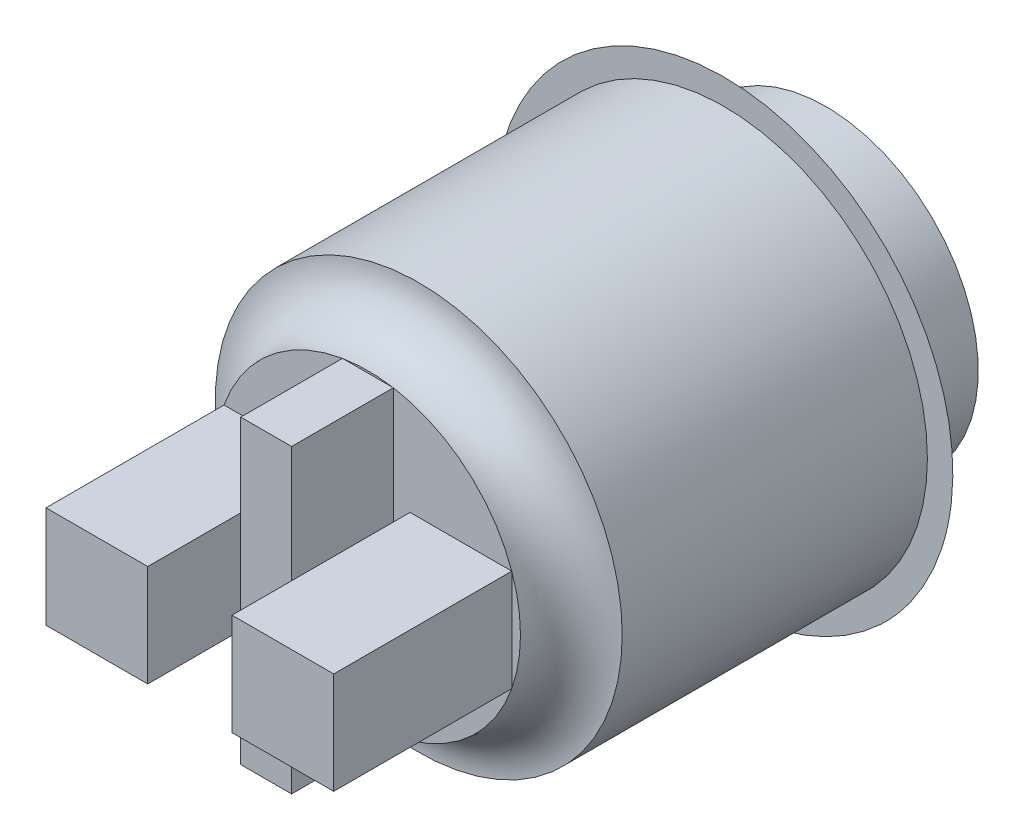
ISO-10303-21;
HEADER;
FILE_DESCRIPTION(('STEP AP214'),'2;1');
FILE_NAME('part.step','',(''),(''),'','','');
FILE_SCHEMA(('AUTOMOTIVE_DESIGN { 1 0 10303 214 1 1 1 1 }'));
ENDSEC;
DATA;
#1=APPLICATION_CONTEXT('core data for automotive mechanical design processes');
#2=APPLICATION_PROTOCOL_DEFINITION('international standard','automotive_design',2000,#1);
#3=PRODUCT_CONTEXT('',#1,'mechanical');
#4=PRODUCT('Part','Part','',(#3));
#5=PRODUCT_RELATED_PRODUCT_CATEGORY('part','',(#4));
#6=PRODUCT_DEFINITION_FORMATION('','',#4);
#7=PRODUCT_DEFINITION_CONTEXT('part definition',#1,'design');
#8=PRODUCT_DEFINITION('design','',#6,#7);
#9=PRODUCT_DEFINITION_SHAPE('','',#8);
#10=(LENGTH_UNIT() NAMED_UNIT(*) SI_UNIT(.MILLI.,.METRE.));
#11=(NAMED_UNIT(*) PLANE_ANGLE_UNIT() SI_UNIT($,.RADIAN.));
#12=(NAMED_UNIT(*) SI_UNIT($,.STERADIAN.) SOLID_ANGLE_UNIT());
#13=UNCERTAINTY_MEASURE_WITH_UNIT(LENGTH_MEASURE(1.E-05),#10,'distance_accuracy_value','');
#14=(GEOMETRIC_REPRESENTATION_CONTEXT(3) GLOBAL_UNCERTAINTY_ASSIGNED_CONTEXT((#13)) GLOBAL_UNIT_ASSIGNED_CONTEXT((#10,
#11,#12)) REPRESENTATION_CONTEXT('',''));
#15=CARTESIAN_POINT('',(0.,0.,0.));
#16=DIRECTION('',(0.,0.,1.));
#17=DIRECTION('',(1.,0.,0.));
#18=AXIS2_PLACEMENT_3D('',#15,#16,#17);
#19=CARTESIAN_POINT('',(0.,0.,14.));
#20=DIRECTION('',(0.,0.,1.));
#21=DIRECTION('',(1.,0.,0.));
#22=AXIS2_PLACEMENT_3D('',#19,#20,#21);
#23=PLANE('',#22);
#24=CARTESIAN_POINT('',(0.,0.,14.));
#25=DIRECTION('',(0.,0.,1.));
#26=DIRECTION('',(1.,0.,0.));
#27=AXIS2_PLACEMENT_3D('',#24,#25,#26);
#28=CIRCLE('',#27,6.);
#29=CARTESIAN_POINT('',(-1.,-5.91607978309962,14.));
#30=VERTEX_POINT('',#29);
#31=CARTESIAN_POINT('',(1.,-5.91607978309962,14.));
#32=VERTEX_POINT('',#31);
#33=EDGE_CURVE('E330',#30,#32,#28,.T.);
#34=ORIENTED_EDGE('',*,*,#33,.T.);
#35=DIRECTION('',(1.,0.,0.));
#36=VECTOR('',#35,1.);
#37=CARTESIAN_POINT('',(-1.,-5.91607978309962,14.));
#38=LINE('',#37,#36);
#39=EDGE_CURVE('E161',#30,#32,#38,.T.);
#40=ORIENTED_EDGE('',*,*,#39,.F.);
#41=EDGE_LOOP('',(#34,#40));
#42=FACE_BOUND('',#41,.T.);
#43=ADVANCED_FACE('F41',(#42),#23,.T.);
#44=CARTESIAN_POINT('',(5.65685424949238,2.,14.));
#45=VERTEX_POINT('',#44);
#46=CARTESIAN_POINT('',(1.,5.91607978309962,14.));
#47=VERTEX_POINT('',#46);
#48=EDGE_CURVE('E339',#45,#47,#28,.T.);
#49=ORIENTED_EDGE('',*,*,#48,.T.);
#50=DIRECTION('',(0.,1.,0.));
#51=VECTOR('',#50,1.);
#52=CARTESIAN_POINT('',(1.,-5.91607978309962,14.));
#53=LINE('',#52,#51);
#54=EDGE_CURVE('E596',#32,#47,#53,.T.);
#55=ORIENTED_EDGE('',*,*,#54,.F.);
#56=CARTESIAN_POINT('',(5.65685424949238,-2.,14.));
#57=VERTEX_POINT('',#56);
#58=EDGE_CURVE('E68',#32,#57,#28,.T.);
#59=ORIENTED_EDGE('',*,*,#58,.T.);
#60=DIRECTION('',(1.,0.,0.));
#61=VECTOR('',#60,1.);
#62=CARTESIAN_POINT('',(1.65685424949238,-2.,14.));
#63=LINE('',#62,#61);
#64=CARTESIAN_POINT('',(1.65685424949238,-2.,14.));
#65=VERTEX_POINT('',#64);
#66=EDGE_CURVE('E190',#65,#57,#63,.T.);
#67=ORIENTED_EDGE('',*,*,#66,.F.);
#68=DIRECTION('',(0.,-1.,0.));
#69=VECTOR('',#68,1.);
#70=CARTESIAN_POINT('',(1.65685424949238,2.,14.));
#71=LINE('',#70,#69);
#72=CARTESIAN_POINT('',(1.65685424949238,2.,14.));
#73=VERTEX_POINT('',#72);
#74=EDGE_CURVE('E168',#73,#65,#71,.T.);
#75=ORIENTED_EDGE('',*,*,#74,.F.);
#76=DIRECTION('',(-1.,0.,0.));
#77=VECTOR('',#76,1.);
#78=CARTESIAN_POINT('',(5.65685424949238,2.,14.));
#79=LINE('',#78,#77);
#80=EDGE_CURVE('E163',#45,#73,#79,.T.);
#81=ORIENTED_EDGE('',*,*,#80,.F.);
#82=EDGE_LOOP('',(#49,#55,#59,#67,#75,#81));
#83=FACE_BOUND('',#82,.T.);
#84=ADVANCED_FACE('F304',(#83),#23,.T.);
#85=CARTESIAN_POINT('',(-0.999999999999992,5.91607978309962,14.));
#86=VERTEX_POINT('',#85);
#87=EDGE_CURVE('E345',#47,#86,#28,.T.);
#88=ORIENTED_EDGE('',*,*,#87,.T.);
#89=DIRECTION('',(-1.,0.,0.));
#90=VECTOR('',#89,1.);
#91=CARTESIAN_POINT('',(-1.,5.91607978309962,14.));
#92=LINE('',#91,#90);
#93=EDGE_CURVE('E591',#47,#86,#92,.T.);
#94=ORIENTED_EDGE('',*,*,#93,.F.);
#95=EDGE_LOOP('',(#88,#94));
#96=FACE_BOUND('',#95,.T.);
#97=ADVANCED_FACE('F310',(#96),#23,.T.);
#98=CARTESIAN_POINT('',(-5.65685424949238,-2.,14.));
#99=VERTEX_POINT('',#98);
#100=EDGE_CURVE('E257',#99,#30,#28,.T.);
#101=ORIENTED_EDGE('',*,*,#100,.T.);
#102=DIRECTION('',(0.,-1.,0.));
#103=VECTOR('',#102,1.);
#104=CARTESIAN_POINT('',(-1.,-5.91607978309962,14.));
#105=LINE('',#104,#103);
#106=EDGE_CURVE('E157',#86,#30,#105,.T.);
#107=ORIENTED_EDGE('',*,*,#106,.F.);
#108=CARTESIAN_POINT('',(-5.65685424949238,2.,14.));
#109=VERTEX_POINT('',#108);
#110=EDGE_CURVE('E251',#86,#109,#28,.T.);
#111=ORIENTED_EDGE('',*,*,#110,.T.);
#112=DIRECTION('',(-1.,0.,0.));
#113=VECTOR('',#112,1.);
#114=CARTESIAN_POINT('',(-5.65685424949238,2.,14.));
#115=LINE('',#114,#113);
#116=CARTESIAN_POINT('',(-1.65685424949238,2.,14.));
#117=VERTEX_POINT('',#116);
#118=EDGE_CURVE('E209',#117,#109,#115,.T.);
#119=ORIENTED_EDGE('',*,*,#118,.F.);
#120=DIRECTION('',(0.,1.,0.));
#121=VECTOR('',#120,1.);
#122=CARTESIAN_POINT('',(-1.65685424949238,2.,14.));
#123=LINE('',#122,#121);
#124=CARTESIAN_POINT('',(-1.65685424949238,-2.,14.));
#125=VERTEX_POINT('',#124);
#126=EDGE_CURVE('E215',#125,#117,#123,.T.);
#127=ORIENTED_EDGE('',*,*,#126,.F.);
#128=DIRECTION('',(1.,0.,0.));
#129=VECTOR('',#128,1.);
#130=CARTESIAN_POINT('',(-1.65685424949238,-2.,14.));
#131=LINE('',#130,#129);
#132=EDGE_CURVE('E231',#99,#125,#131,.T.);
#133=ORIENTED_EDGE('',*,*,#132,.F.);
#134=EDGE_LOOP('',(#101,#107,#111,#119,#127,#133));
#135=FACE_BOUND('',#134,.T.);
#136=ADVANCED_FACE('F319',(#135),#23,.T.);
#137=EDGE_CURVE('E335',#57,#45,#28,.T.);
#138=ORIENTED_EDGE('',*,*,#137,.T.);
#139=DIRECTION('',(0.,1.,0.));
#140=VECTOR('',#139,1.);
#141=CARTESIAN_POINT('',(5.65685424949238,2.,14.));
#142=LINE('',#141,#140);
#143=EDGE_CURVE('E178',#57,#45,#142,.T.);
#144=ORIENTED_EDGE('',*,*,#143,.F.);
#145=EDGE_LOOP('',(#138,#144));
#146=FACE_BOUND('',#145,.T.);
#147=ADVANCED_FACE('F314',(#146),#23,.T.);
#148=EDGE_CURVE('E252',#109,#99,#28,.T.);
#149=ORIENTED_EDGE('',*,*,#148,.T.);
#150=DIRECTION('',(0.,-1.,0.));
#151=VECTOR('',#150,1.);
#152=CARTESIAN_POINT('',(-5.65685424949238,2.,14.));
#153=LINE('',#152,#151);
#154=EDGE_CURVE('E228',#109,#99,#153,.T.);
#155=ORIENTED_EDGE('',*,*,#154,.F.);
#156=EDGE_LOOP('',(#149,#155));
#157=FACE_BOUND('',#156,.T.);
#158=ADVANCED_FACE('F299',(#157),#23,.T.);
#159=CARTESIAN_POINT('',(0.,0.,14.));
#160=DIRECTION('',(0.,0.,1.));
#161=DIRECTION('',(1.,0.,0.));
#162=AXIS2_PLACEMENT_3D('',#159,#160,#161);
#163=TOROIDAL_SURFACE('',#162,8.,2.);
#164=ORIENTED_EDGE('',*,*,#148,.F.);
#165=ORIENTED_EDGE('',*,*,#110,.F.);
#166=ORIENTED_EDGE('',*,*,#87,.F.);
#167=ORIENTED_EDGE('',*,*,#48,.F.);
#168=ORIENTED_EDGE('',*,*,#137,.F.);
#169=ORIENTED_EDGE('',*,*,#58,.F.);
#170=ORIENTED_EDGE('',*,*,#33,.F.);
#171=ORIENTED_EDGE('',*,*,#100,.F.);
#172=EDGE_LOOP('',(#164,#165,#166,#167,#168,#169,#170,#171));
#173=FACE_BOUND('',#172,.T.);
#174=CARTESIAN_POINT('',(0.,0.,12.));
#175=DIRECTION('',(0.,0.,1.));
#176=DIRECTION('',(1.,0.,0.));
#177=AXIS2_PLACEMENT_3D('',#174,#175,#176);
#178=CIRCLE('',#177,8.);
#179=CARTESIAN_POINT('',(8.,0.,12.));
#180=VERTEX_POINT('',#179);
#181=EDGE_CURVE('E12',#180,#180,#178,.T.);
#182=ORIENTED_EDGE('',*,*,#181,.T.);
#183=EDGE_LOOP('',(#182));
#184=FACE_BOUND('',#183,.T.);
#185=ADVANCED_FACE('F43',(#173,#184),#163,.F.);
#186=CARTESIAN_POINT('',(0.,0.,12.));
#187=DIRECTION('',(0.,0.,-1.));
#188=DIRECTION('',(-1.,0.,0.));
#189=AXIS2_PLACEMENT_3D('',#186,#187,#188);
#190=CYLINDRICAL_SURFACE('',#189,8.);
#191=ORIENTED_EDGE('',*,*,#181,.F.);
#192=EDGE_LOOP('',(#191));
#193=FACE_BOUND('',#192,.T.);
#194=CARTESIAN_POINT('',(0.,0.,0.));
#195=DIRECTION('',(0.,0.,1.));
#196=DIRECTION('',(1.,0.,0.));
#197=AXIS2_PLACEMENT_3D('',#194,#195,#196);
#198=CIRCLE('',#197,8.);
#199=CARTESIAN_POINT('',(8.,0.,0.));
#200=VERTEX_POINT('',#199);
#201=EDGE_CURVE('E52',#200,#200,#198,.T.);
#202=ORIENTED_EDGE('',*,*,#201,.T.);
#203=EDGE_LOOP('',(#202));
#204=FACE_BOUND('',#203,.T.);
#205=ADVANCED_FACE('F292',(#193,#204),#190,.T.);
#206=CARTESIAN_POINT('',(0.,0.,0.));
#207=DIRECTION('',(0.,0.,-1.));
#208=DIRECTION('',(-1.,0.,0.));
#209=AXIS2_PLACEMENT_3D('',#206,#207,#208);
#210=PLANE('',#209);
#211=ORIENTED_EDGE('',*,*,#201,.F.);
#212=EDGE_LOOP('',(#211));
#213=FACE_BOUND('',#212,.T.);
#214=CARTESIAN_POINT('',(0.,0.,0.));
#215=DIRECTION('',(0.,0.,-1.));
#216=DIRECTION('',(-1.,0.,0.));
#217=AXIS2_PLACEMENT_3D('',#214,#215,#216);
#218=CIRCLE('',#217,9.);
#219=CARTESIAN_POINT('',(-8.04963755899103,4.02533665286283,0.));
#220=VERTEX_POINT('',#219);
#221=EDGE_CURVE('E401',#220,#220,#218,.T.);
#222=ORIENTED_EDGE('',*,*,#221,.F.);
#223=EDGE_LOOP('',(#222));
#224=FACE_BOUND('',#223,.T.);
#225=ADVANCED_FACE('F283',(#213,#224),#210,.F.);
#226=CARTESIAN_POINT('',(-5.95524099513286,0.731508502950559,-2.));
#227=CARTESIAN_POINT('',(-8.04963755899103,4.02533665286283,0.));
#228=CARTESIAN_POINT('',(-7.41825800103398,-11.1789734873152,-2.));
#229=CARTESIAN_POINT('',(-16.1003108647167,-12.0739384651192,0.));
#230=CARTESIAN_POINT('',(4.49222398923175,-12.6419904932163,-2.));
#231=CARTESIAN_POINT('',(-0.00103574673462892,-20.1246117708449,0.));
#232=CARTESIAN_POINT('',(5.95524099513286,-0.731508502950558,-2.));
#233=CARTESIAN_POINT('',(8.04963755899103,-4.02533665286283,0.));
#234=CARTESIAN_POINT('',(7.41825800103398,11.1789734873152,-2.));
#235=CARTESIAN_POINT('',(16.1003108647167,12.0739384651192,0.));
#236=CARTESIAN_POINT('',(-4.49222398923174,12.6419904932163,-2.));
#237=CARTESIAN_POINT('',(0.00103574673463239,20.1246117708449,0.));
#238=CARTESIAN_POINT('',(-5.95524099513286,0.731508502950559,-2.));
#239=CARTESIAN_POINT('',(-8.04963755899103,4.02533665286283,0.));
#240=(BOUNDED_SURFACE() B_SPLINE_SURFACE(3,1,((#226,#227),(#228,#229),(#230,#231),(#232,#233),
(#234,#235),(#236,#237),(#238,#239)),.UNSPECIFIED.,.T.,.F.,.F.) B_SPLINE_SURFACE_WITH_KNOTS((4,
3,4),(2,2),(0.,0.5,1.),(0.,1.),
.UNSPECIFIED.) GEOMETRIC_REPRESENTATION_ITEM() RATIONAL_B_SPLINE_SURFACE(((1.,1.),
(0.333333333333333,0.333333333333333),(0.333333333333333,0.333333333333333),(1.,1.),
(0.333333333333333,0.333333333333333),(0.333333333333333,0.333333333333333),(1.,1.))) REPRESENTATION_ITEM('') SURFACE());
#241=CARTESIAN_POINT('',(0.,0.,-2.));
#242=DIRECTION('',(0.,0.,-1.));
#243=DIRECTION('',(-1.,0.,0.));
#244=AXIS2_PLACEMENT_3D('',#241,#242,#243);
#245=CIRCLE('',#244,6.);
#246=CARTESIAN_POINT('',(-5.95524099513286,0.731508502950559,-2.));
#247=VERTEX_POINT('',#246);
#248=EDGE_CURVE('E45',#247,#247,#245,.T.);
#249=CARTESIAN_POINT('',(-5.95524099513286,0.731508502950559,-2.));
#250=CARTESIAN_POINT('',(-5.97705762600638,0.765819212845479,-1.97916666666667));
#251=CARTESIAN_POINT('',(-5.99887425687991,0.800129922740398,-1.95833333333333));
#252=CARTESIAN_POINT('',(-6.04250751862695,0.868751342530237,-1.91666666666667));
#253=CARTESIAN_POINT('',(-6.06432414950048,0.903062052425156,-1.89583333333333));
#254=CARTESIAN_POINT('',(-6.10795741124752,0.971683472214996,-1.85416666666667));
#255=CARTESIAN_POINT('',(-6.12977404212104,1.00599418210992,-1.83333333333333));
#256=CARTESIAN_POINT('',(-6.17340730386809,1.07461560189975,-1.79166666666667));
#257=CARTESIAN_POINT('',(-6.19522393474161,1.10892631179467,-1.77083333333333));
#258=CARTESIAN_POINT('',(-6.23885719648866,1.17754773158451,-1.72916666666667));
#259=CARTESIAN_POINT('',(-6.26067382736218,1.21185844147943,-1.70833333333333));
#260=CARTESIAN_POINT('',(-6.30430708910922,1.28047986126927,-1.66666666666667));
#261=CARTESIAN_POINT('',(-6.32612371998275,1.31479057116419,-1.64583333333333));
#262=CARTESIAN_POINT('',(-6.36975698172979,1.38341199095403,-1.60416666666667));
#263=CARTESIAN_POINT('',(-6.39157361260331,1.41772270084895,-1.58333333333333));
#264=CARTESIAN_POINT('',(-6.43520687435036,1.48634412063879,-1.54166666666667));
#265=CARTESIAN_POINT('',(-6.45702350522388,1.52065483053371,-1.52083333333333));
#266=CARTESIAN_POINT('',(-6.50065676697093,1.58927625032355,-1.47916666666667));
#267=CARTESIAN_POINT('',(-6.52247339784445,1.62358696021847,-1.45833333333333));
#268=CARTESIAN_POINT('',(-6.56610665959149,1.6922083800083,-1.41666666666667));
#269=CARTESIAN_POINT('',(-6.58792329046502,1.72651908990322,-1.39583333333333));
#270=CARTESIAN_POINT('',(-6.63155655221206,1.79514050969306,-1.35416666666667));
#271=CARTESIAN_POINT('',(-6.65337318308558,1.82945121958798,-1.33333333333333));
#272=CARTESIAN_POINT('',(-6.69700644483263,1.89807263937782,-1.29166666666667));
#273=CARTESIAN_POINT('',(-6.71882307570615,1.93238334927274,-1.27083333333333));
#274=CARTESIAN_POINT('',(-6.7624563374532,2.00100476906258,-1.22916666666667));
#275=CARTESIAN_POINT('',(-6.78427296832672,2.0353154789575,-1.20833333333333));
#276=CARTESIAN_POINT('',(-6.82790623007377,2.10393689874734,-1.16666666666667));
#277=CARTESIAN_POINT('',(-6.84972286094729,2.13824760864226,-1.14583333333333));
#278=CARTESIAN_POINT('',(-6.89335612269433,2.2068690284321,-1.10416666666667));
#279=CARTESIAN_POINT('',(-6.91517275356785,2.24117973832702,-1.08333333333333));
#280=CARTESIAN_POINT('',(-6.9588060153149,2.30980115811686,-1.04166666666667));
#281=CARTESIAN_POINT('',(-6.98062264618842,2.34411186801178,-1.02083333333333));
#282=CARTESIAN_POINT('',(-7.02425590793547,2.41273328780161,-0.979166666666667));
#283=CARTESIAN_POINT('',(-7.04607253880899,2.44704399769653,-0.958333333333333));
#284=CARTESIAN_POINT('',(-7.08970580055604,2.51566541748637,-0.916666666666667));
#285=CARTESIAN_POINT('',(-7.11152243142956,2.54997612738129,-0.895833333333333));
#286=CARTESIAN_POINT('',(-7.1551556931766,2.61859754717113,-0.854166666666667));
#287=CARTESIAN_POINT('',(-7.17697232405013,2.65290825706605,-0.833333333333333));
#288=CARTESIAN_POINT('',(-7.22060558579717,2.72152967685589,-0.791666666666667));
#289=CARTESIAN_POINT('',(-7.24242221667069,2.75584038675081,-0.770833333333333));
#290=CARTESIAN_POINT('',(-7.28605547841774,2.82446180654065,-0.729166666666667));
#291=CARTESIAN_POINT('',(-7.30787210929126,2.85877251643557,-0.708333333333333));
#292=CARTESIAN_POINT('',(-7.35150537103831,2.92739393622541,-0.666666666666667));
#293=CARTESIAN_POINT('',(-7.37332200191183,2.96170464612033,-0.645833333333333));
#294=CARTESIAN_POINT('',(-7.41695526365887,3.03032606591017,-0.604166666666667));
#295=CARTESIAN_POINT('',(-7.4387718945324,3.06463677580509,-0.583333333333333));
#296=CARTESIAN_POINT('',(-7.48240515627944,3.13325819559492,-0.541666666666667));
#297=CARTESIAN_POINT('',(-7.50422178715296,3.16756890548984,-0.520833333333333));
#298=CARTESIAN_POINT('',(-7.54785504890001,3.23619032527968,-0.479166666666667));
#299=CARTESIAN_POINT('',(-7.56967167977353,3.2705010351746,-0.458333333333333));
#300=CARTESIAN_POINT('',(-7.61330494152058,3.33912245496444,-0.416666666666667));
#301=CARTESIAN_POINT('',(-7.6351215723941,3.37343316485936,-0.395833333333333));
#302=CARTESIAN_POINT('',(-7.67875483414115,3.4420545846492,-0.354166666666667));
#303=CARTESIAN_POINT('',(-7.70057146501467,3.47636529454412,-0.333333333333333));
#304=CARTESIAN_POINT('',(-7.74420472676171,3.54498671433396,-0.291666666666667));
#305=CARTESIAN_POINT('',(-7.76602135763524,3.57929742422888,-0.270833333333333));
#306=CARTESIAN_POINT('',(-7.80965461938228,3.64791884401872,-0.229166666666667));
#307=CARTESIAN_POINT('',(-7.8314712502558,3.68222955391364,-0.208333333333333));
#308=CARTESIAN_POINT('',(-7.87510451200285,3.75085097370347,-0.166666666666667));
#309=CARTESIAN_POINT('',(-7.89692114287637,3.7851616835984,-0.145833333333333));
#310=CARTESIAN_POINT('',(-7.94055440462342,3.85378310338823,-0.104166666666667));
#311=CARTESIAN_POINT('',(-7.96237103549694,3.88809381328315,-0.0833333333333333));
#312=CARTESIAN_POINT('',(-8.00600429724398,3.95671523307299,-0.0416666666666666));
#313=CARTESIAN_POINT('',(-8.02782092811751,3.99102594296791,-0.0208333333333333));
#314=CARTESIAN_POINT('',(-8.04963755899103,4.02533665286283,0.));
#315=B_SPLINE_CURVE_WITH_KNOTS('',3,(#249,#250,#251,#252,#253,#254,#255,#256,#257,#258,#259,
#260,#261,#262,#263,#264,#265,#266,#267,#268,#269,#270,#271,#272,#273,#274,#275,#276,#277,#278,
#279,#280,#281,#282,#283,#284,#285,#286,#287,#288,#289,#290,#291,#292,#293,#294,#295,#296,#297,
#298,#299,#300,#301,#302,#303,#304,#305,#306,#307,#308,#309,#310,#311,#312,#313,#314),
.UNSPECIFIED.,.F.,.F.,(4,2,2,2,2,2,2,2,2,2,2,2,2,2,2,2,2,2,2,2,2,2,2,2,2,2,2,2,2,2,2,2,4),(0.,
0.137058242238414,0.274116484476828,0.411174726715242,0.548232968953656,0.68529121119207,
0.822349453430484,0.959407695668898,1.09646593790731,1.23352418014573,1.37058242238414,
1.50764066462255,1.64469890686097,1.78175714909938,1.9188153913378,2.05587363357621,
2.19293187581463,2.32999011805304,2.46704836029145,2.60410660252987,2.74116484476828,
2.8782230870067,3.01528132924511,3.15233957148352,3.28939781372194,3.42645605596035,
3.56351429819877,3.70057254043718,3.8376307826756,3.97468902491401,4.11174726715242,
4.24880550939084,4.38586375162925),.UNSPECIFIED.);
#316=EDGE_CURVE('BSEAM270',#247,#220,#315,.T.);
#317=ORIENTED_EDGE('',*,*,#248,.F.);
#318=ORIENTED_EDGE('',*,*,#221,.T.);
#319=ORIENTED_EDGE('',*,*,#316,.T.);
#320=ORIENTED_EDGE('',*,*,#316,.F.);
#321=EDGE_LOOP('',(#317,#319,#318,#320));
#322=FACE_BOUND('',#321,.T.);
#323=ADVANCED_FACE('F270',(#322),#240,.T.);
#324=CARTESIAN_POINT('',(0.,0.,-4.));
#325=DIRECTION('',(0.,0.,1.));
#326=DIRECTION('',(1.,0.,0.));
#327=AXIS2_PLACEMENT_3D('',#324,#325,#326);
#328=CYLINDRICAL_SURFACE('',#327,6.);
#329=CARTESIAN_POINT('',(0.,0.,-4.));
#330=DIRECTION('',(0.,0.,-1.));
#331=DIRECTION('',(-1.,0.,0.));
#332=AXIS2_PLACEMENT_3D('',#329,#330,#331);
#333=CIRCLE('',#332,6.);
#334=CARTESIAN_POINT('',(-6.,0.,-4.));
#335=VERTEX_POINT('',#334);
#336=EDGE_CURVE('E256',#335,#335,#333,.T.);
#337=ORIENTED_EDGE('',*,*,#336,.F.);
#338=EDGE_LOOP('',(#337));
#339=FACE_BOUND('',#338,.T.);
#340=ORIENTED_EDGE('',*,*,#248,.T.);
#341=EDGE_LOOP('',(#340));
#342=FACE_BOUND('',#341,.T.);
#343=ADVANCED_FACE('F282',(#339,#342),#328,.T.);
#344=CARTESIAN_POINT('',(0.,0.,-4.));
#345=DIRECTION('',(0.,0.,-1.));
#346=DIRECTION('',(-1.,0.,0.));
#347=AXIS2_PLACEMENT_3D('',#344,#345,#346);
#348=PLANE('',#347);
#349=ORIENTED_EDGE('',*,*,#336,.T.);
#350=EDGE_LOOP('',(#349));
#351=FACE_BOUND('',#350,.T.);
#352=ADVANCED_FACE('F388',(#351),#348,.T.);
#353=CARTESIAN_POINT('',(-5.65685424949238,2.,21.));
#354=DIRECTION('',(0.,-1.,0.));
#355=DIRECTION('',(0.,0.,-1.));
#356=AXIS2_PLACEMENT_3D('',#353,#354,#355);
#357=PLANE('',#356);
#358=ORIENTED_EDGE('',*,*,#118,.T.);
#359=DIRECTION('',(0.,0.,-1.));
#360=VECTOR('',#359,1.);
#361=CARTESIAN_POINT('',(-5.65685424949238,2.,21.));
#362=LINE('',#361,#360);
#363=CARTESIAN_POINT('',(-5.65685424949238,2.,21.));
#364=VERTEX_POINT('',#363);
#365=EDGE_CURVE('E247',#364,#109,#362,.T.);
#366=ORIENTED_EDGE('',*,*,#365,.F.);
#367=DIRECTION('',(-1.,0.,0.));
#368=VECTOR('',#367,1.);
#369=CARTESIAN_POINT('',(-5.65685424949238,2.,21.));
#370=LINE('',#369,#368);
#371=CARTESIAN_POINT('',(-1.65685424949238,2.,21.));
#372=VERTEX_POINT('',#371);
#373=EDGE_CURVE('E210',#372,#364,#370,.T.);
#374=ORIENTED_EDGE('',*,*,#373,.F.);
#375=DIRECTION('',(0.,0.,-1.));
#376=VECTOR('',#375,1.);
#377=CARTESIAN_POINT('',(-1.65685424949238,2.,21.));
#378=LINE('',#377,#376);
#379=EDGE_CURVE('E224',#372,#117,#378,.T.);
#380=ORIENTED_EDGE('',*,*,#379,.T.);
#381=EDGE_LOOP('',(#358,#366,#374,#380));
#382=FACE_BOUND('',#381,.T.);
#383=ADVANCED_FACE('F360',(#382),#357,.F.);
#384=CARTESIAN_POINT('',(-5.65685424949238,2.,21.));
#385=DIRECTION('',(1.,0.,0.));
#386=DIRECTION('',(0.,0.,-1.));
#387=AXIS2_PLACEMENT_3D('',#384,#385,#386);
#388=PLANE('',#387);
#389=ORIENTED_EDGE('',*,*,#154,.T.);
#390=DIRECTION('',(0.,0.,-1.));
#391=VECTOR('',#390,1.);
#392=CARTESIAN_POINT('',(-5.65685424949238,-2.,21.));
#393=LINE('',#392,#391);
#394=CARTESIAN_POINT('',(-5.65685424949238,-2.,21.));
#395=VERTEX_POINT('',#394);
#396=EDGE_CURVE('E243',#395,#99,#393,.T.);
#397=ORIENTED_EDGE('',*,*,#396,.F.);
#398=DIRECTION('',(0.,-1.,0.));
#399=VECTOR('',#398,1.);
#400=CARTESIAN_POINT('',(-5.65685424949238,2.,21.));
#401=LINE('',#400,#399);
#402=EDGE_CURVE('E214',#364,#395,#401,.T.);
#403=ORIENTED_EDGE('',*,*,#402,.F.);
#404=ORIENTED_EDGE('',*,*,#365,.T.);
#405=EDGE_LOOP('',(#389,#397,#403,#404));
#406=FACE_BOUND('',#405,.T.);
#407=ADVANCED_FACE('F356',(#406),#388,.F.);
#408=CARTESIAN_POINT('',(-1.65685424949238,-2.,21.));
#409=DIRECTION('',(0.,1.,0.));
#410=DIRECTION('',(0.,0.,1.));
#411=AXIS2_PLACEMENT_3D('',#408,#409,#410);
#412=PLANE('',#411);
#413=ORIENTED_EDGE('',*,*,#132,.T.);
#414=DIRECTION('',(0.,0.,-1.));
#415=VECTOR('',#414,1.);
#416=CARTESIAN_POINT('',(-1.65685424949238,-2.,21.));
#417=LINE('',#416,#415);
#418=CARTESIAN_POINT('',(-1.65685424949238,-2.,21.));
#419=VERTEX_POINT('',#418);
#420=EDGE_CURVE('E240',#419,#125,#417,.T.);
#421=ORIENTED_EDGE('',*,*,#420,.F.);
#422=DIRECTION('',(1.,0.,0.));
#423=VECTOR('',#422,1.);
#424=CARTESIAN_POINT('',(-1.65685424949238,-2.,21.));
#425=LINE('',#424,#423);
#426=EDGE_CURVE('E218',#395,#419,#425,.T.);
#427=ORIENTED_EDGE('',*,*,#426,.F.);
#428=ORIENTED_EDGE('',*,*,#396,.T.);
#429=EDGE_LOOP('',(#413,#421,#427,#428));
#430=FACE_BOUND('',#429,.T.);
#431=ADVANCED_FACE('F367',(#430),#412,.F.);
#432=CARTESIAN_POINT('',(-1.65685424949238,2.,21.));
#433=DIRECTION('',(-1.,0.,0.));
#434=DIRECTION('',(0.,0.,1.));
#435=AXIS2_PLACEMENT_3D('',#432,#433,#434);
#436=PLANE('',#435);
#437=ORIENTED_EDGE('',*,*,#126,.T.);
#438=ORIENTED_EDGE('',*,*,#379,.F.);
#439=DIRECTION('',(0.,1.,0.));
#440=VECTOR('',#439,1.);
#441=CARTESIAN_POINT('',(-1.65685424949238,2.,21.));
#442=LINE('',#441,#440);
#443=EDGE_CURVE('E221',#419,#372,#442,.T.);
#444=ORIENTED_EDGE('',*,*,#443,.F.);
#445=ORIENTED_EDGE('',*,*,#420,.T.);
#446=EDGE_LOOP('',(#437,#438,#444,#445));
#447=FACE_BOUND('',#446,.T.);
#448=ADVANCED_FACE('F364',(#447),#436,.F.);
#449=CARTESIAN_POINT('',(0.,0.,21.));
#450=DIRECTION('',(0.,0.,-1.));
#451=DIRECTION('',(-1.,0.,0.));
#452=AXIS2_PLACEMENT_3D('',#449,#450,#451);
#453=PLANE('',#452);
#454=ORIENTED_EDGE('',*,*,#373,.T.);
#455=ORIENTED_EDGE('',*,*,#402,.T.);
#456=ORIENTED_EDGE('',*,*,#426,.T.);
#457=ORIENTED_EDGE('',*,*,#443,.T.);
#458=EDGE_LOOP('',(#454,#455,#456,#457));
#459=FACE_BOUND('',#458,.T.);
#460=ADVANCED_FACE('F370',(#459),#453,.F.);
#461=CARTESIAN_POINT('',(5.65685424949238,2.,21.));
#462=DIRECTION('',(0.,-1.,0.));
#463=DIRECTION('',(0.,0.,-1.));
#464=AXIS2_PLACEMENT_3D('',#461,#462,#463);
#465=PLANE('',#464);
#466=ORIENTED_EDGE('',*,*,#80,.T.);
#467=DIRECTION('',(0.,0.,-1.));
#468=VECTOR('',#467,1.);
#469=CARTESIAN_POINT('',(1.65685424949238,2.,21.));
#470=LINE('',#469,#468);
#471=CARTESIAN_POINT('',(1.65685424949238,2.,21.));
#472=VERTEX_POINT('',#471);
#473=EDGE_CURVE('E206',#472,#73,#470,.T.);
#474=ORIENTED_EDGE('',*,*,#473,.F.);
#475=DIRECTION('',(-1.,0.,0.));
#476=VECTOR('',#475,1.);
#477=CARTESIAN_POINT('',(5.65685424949238,2.,21.));
#478=LINE('',#477,#476);
#479=CARTESIAN_POINT('',(5.65685424949238,2.,21.));
#480=VERTEX_POINT('',#479);
#481=EDGE_CURVE('E173',#480,#472,#478,.T.);
#482=ORIENTED_EDGE('',*,*,#481,.F.);
#483=DIRECTION('',(0.,0.,-1.));
#484=VECTOR('',#483,1.);
#485=CARTESIAN_POINT('',(5.65685424949238,2.,21.));
#486=LINE('',#485,#484);
#487=EDGE_CURVE('E186',#480,#45,#486,.T.);
#488=ORIENTED_EDGE('',*,*,#487,.T.);
#489=EDGE_LOOP('',(#466,#474,#482,#488));
#490=FACE_BOUND('',#489,.T.);
#491=ADVANCED_FACE('F372',(#490),#465,.F.);
#492=CARTESIAN_POINT('',(1.65685424949238,2.,21.));
#493=DIRECTION('',(1.,0.,0.));
#494=DIRECTION('',(0.,1.,0.));
#495=AXIS2_PLACEMENT_3D('',#492,#493,#494);
#496=PLANE('',#495);
#497=ORIENTED_EDGE('',*,*,#74,.T.);
#498=DIRECTION('',(0.,0.,-1.));
#499=VECTOR('',#498,1.);
#500=CARTESIAN_POINT('',(1.65685424949238,-2.,21.));
#501=LINE('',#500,#499);
#502=CARTESIAN_POINT('',(1.65685424949238,-2.,21.));
#503=VERTEX_POINT('',#502);
#504=EDGE_CURVE('E202',#503,#65,#501,.T.);
#505=ORIENTED_EDGE('',*,*,#504,.F.);
#506=DIRECTION('',(0.,-1.,0.));
#507=VECTOR('',#506,1.);
#508=CARTESIAN_POINT('',(1.65685424949238,2.,21.));
#509=LINE('',#508,#507);
#510=EDGE_CURVE('E177',#472,#503,#509,.T.);
#511=ORIENTED_EDGE('',*,*,#510,.F.);
#512=ORIENTED_EDGE('',*,*,#473,.T.);
#513=EDGE_LOOP('',(#497,#505,#511,#512));
#514=FACE_BOUND('',#513,.T.);
#515=ADVANCED_FACE('F378',(#514),#496,.F.);
#516=CARTESIAN_POINT('',(1.65685424949238,-2.,21.));
#517=DIRECTION('',(0.,1.,0.));
#518=DIRECTION('',(0.,0.,1.));
#519=AXIS2_PLACEMENT_3D('',#516,#517,#518);
#520=PLANE('',#519);
#521=ORIENTED_EDGE('',*,*,#66,.T.);
#522=DIRECTION('',(0.,0.,-1.));
#523=VECTOR('',#522,1.);
#524=CARTESIAN_POINT('',(5.65685424949238,-2.,21.));
#525=LINE('',#524,#523);
#526=CARTESIAN_POINT('',(5.65685424949238,-2.,21.));
#527=VERTEX_POINT('',#526);
#528=EDGE_CURVE('E199',#527,#57,#525,.T.);
#529=ORIENTED_EDGE('',*,*,#528,.F.);
#530=DIRECTION('',(1.,0.,0.));
#531=VECTOR('',#530,1.);
#532=CARTESIAN_POINT('',(1.65685424949238,-2.,21.));
#533=LINE('',#532,#531);
#534=EDGE_CURVE('E181',#503,#527,#533,.T.);
#535=ORIENTED_EDGE('',*,*,#534,.F.);
#536=ORIENTED_EDGE('',*,*,#504,.T.);
#537=EDGE_LOOP('',(#521,#529,#535,#536));
#538=FACE_BOUND('',#537,.T.);
#539=ADVANCED_FACE('F494',(#538),#520,.F.);
#540=CARTESIAN_POINT('',(5.65685424949238,2.,21.));
#541=DIRECTION('',(-1.,0.,0.));
#542=DIRECTION('',(0.,0.,1.));
#543=AXIS2_PLACEMENT_3D('',#540,#541,#542);
#544=PLANE('',#543);
#545=ORIENTED_EDGE('',*,*,#143,.T.);
#546=ORIENTED_EDGE('',*,*,#487,.F.);
#547=DIRECTION('',(0.,1.,0.));
#548=VECTOR('',#547,1.);
#549=CARTESIAN_POINT('',(5.65685424949238,2.,21.));
#550=LINE('',#549,#548);
#551=EDGE_CURVE('E184',#527,#480,#550,.T.);
#552=ORIENTED_EDGE('',*,*,#551,.F.);
#553=ORIENTED_EDGE('',*,*,#528,.T.);
#554=EDGE_LOOP('',(#545,#546,#552,#553));
#555=FACE_BOUND('',#554,.T.);
#556=ADVANCED_FACE('F502',(#555),#544,.F.);
#557=CARTESIAN_POINT('',(0.,0.,21.));
#558=DIRECTION('',(0.,0.,1.));
#559=DIRECTION('',(1.,0.,0.));
#560=AXIS2_PLACEMENT_3D('',#557,#558,#559);
#561=PLANE('',#560);
#562=ORIENTED_EDGE('',*,*,#481,.T.);
#563=ORIENTED_EDGE('',*,*,#510,.T.);
#564=ORIENTED_EDGE('',*,*,#534,.T.);
#565=ORIENTED_EDGE('',*,*,#551,.T.);
#566=EDGE_LOOP('',(#562,#563,#564,#565));
#567=FACE_BOUND('',#566,.T.);
#568=ADVANCED_FACE('F511',(#567),#561,.T.);
#569=CARTESIAN_POINT('',(-1.,-5.91607978309962,18.));
#570=DIRECTION('',(0.,1.,0.));
#571=DIRECTION('',(0.,0.,1.));
#572=AXIS2_PLACEMENT_3D('',#569,#570,#571);
#573=PLANE('',#572);
#574=ORIENTED_EDGE('',*,*,#39,.T.);
#575=DIRECTION('',(0.,0.,-1.));
#576=VECTOR('',#575,1.);
#577=CARTESIAN_POINT('',(1.,-5.91607978309962,18.));
#578=LINE('',#577,#576);
#579=CARTESIAN_POINT('',(1.,-5.91607978309962,18.));
#580=VERTEX_POINT('',#579);
#581=EDGE_CURVE('E140',#580,#32,#578,.T.);
#582=ORIENTED_EDGE('',*,*,#581,.F.);
#583=DIRECTION('',(1.,0.,0.));
#584=VECTOR('',#583,1.);
#585=CARTESIAN_POINT('',(-1.,-5.91607978309962,18.));
#586=LINE('',#585,#584);
#587=CARTESIAN_POINT('',(-1.,-5.91607978309962,18.));
#588=VERTEX_POINT('',#587);
#589=EDGE_CURVE('E148',#588,#580,#586,.T.);
#590=ORIENTED_EDGE('',*,*,#589,.F.);
#591=DIRECTION('',(0.,0.,-1.));
#592=VECTOR('',#591,1.);
#593=CARTESIAN_POINT('',(-1.,-5.91607978309962,18.));
#594=LINE('',#593,#592);
#595=EDGE_CURVE('E589',#588,#30,#594,.T.);
#596=ORIENTED_EDGE('',*,*,#595,.T.);
#597=EDGE_LOOP('',(#574,#582,#590,#596));
#598=FACE_BOUND('',#597,.T.);
#599=ADVANCED_FACE('F159',(#598),#573,.F.);
#600=CARTESIAN_POINT('',(1.,-5.91607978309962,18.));
#601=DIRECTION('',(-1.,0.,0.));
#602=DIRECTION('',(0.,0.,1.));
#603=AXIS2_PLACEMENT_3D('',#600,#601,#602);
#604=PLANE('',#603);
#605=ORIENTED_EDGE('',*,*,#54,.T.);
#606=DIRECTION('',(0.,0.,-1.));
#607=VECTOR('',#606,1.);
#608=CARTESIAN_POINT('',(1.,5.91607978309962,18.));
#609=LINE('',#608,#607);
#610=CARTESIAN_POINT('',(1.,5.91607978309962,18.));
#611=VERTEX_POINT('',#610);
#612=EDGE_CURVE('E143',#611,#47,#609,.T.);
#613=ORIENTED_EDGE('',*,*,#612,.F.);
#614=DIRECTION('',(0.,1.,0.));
#615=VECTOR('',#614,1.);
#616=CARTESIAN_POINT('',(1.,-5.91607978309962,18.));
#617=LINE('',#616,#615);
#618=EDGE_CURVE('E136',#580,#611,#617,.T.);
#619=ORIENTED_EDGE('',*,*,#618,.F.);
#620=ORIENTED_EDGE('',*,*,#581,.T.);
#621=EDGE_LOOP('',(#605,#613,#619,#620));
#622=FACE_BOUND('',#621,.T.);
#623=ADVANCED_FACE('F138',(#622),#604,.F.);
#624=CARTESIAN_POINT('',(-1.,5.91607978309962,18.));
#625=DIRECTION('',(0.,-1.,0.));
#626=DIRECTION('',(0.,0.,-1.));
#627=AXIS2_PLACEMENT_3D('',#624,#625,#626);
#628=PLANE('',#627);
#629=ORIENTED_EDGE('',*,*,#93,.T.);
#630=DIRECTION('',(0.,0.,-1.));
#631=VECTOR('',#630,1.);
#632=CARTESIAN_POINT('',(-1.,5.91607978309962,18.));
#633=LINE('',#632,#631);
#634=CARTESIAN_POINT('',(-1.,5.91607978309962,18.));
#635=VERTEX_POINT('',#634);
#636=EDGE_CURVE('E60',#635,#86,#633,.T.);
#637=ORIENTED_EDGE('',*,*,#636,.F.);
#638=DIRECTION('',(-1.,0.,0.));
#639=VECTOR('',#638,1.);
#640=CARTESIAN_POINT('',(-1.,5.91607978309962,18.));
#641=LINE('',#640,#639);
#642=EDGE_CURVE('E147',#611,#635,#641,.T.);
#643=ORIENTED_EDGE('',*,*,#642,.F.);
#644=ORIENTED_EDGE('',*,*,#612,.T.);
#645=EDGE_LOOP('',(#629,#637,#643,#644));
#646=FACE_BOUND('',#645,.T.);
#647=ADVANCED_FACE('F554',(#646),#628,.F.);
#648=CARTESIAN_POINT('',(-1.,-5.91607978309962,18.));
#649=DIRECTION('',(1.,0.,0.));
#650=DIRECTION('',(0.,0.,-1.));
#651=AXIS2_PLACEMENT_3D('',#648,#649,#650);
#652=PLANE('',#651);
#653=ORIENTED_EDGE('',*,*,#106,.T.);
#654=ORIENTED_EDGE('',*,*,#595,.F.);
#655=DIRECTION('',(0.,-1.,0.));
#656=VECTOR('',#655,1.);
#657=CARTESIAN_POINT('',(-1.,-5.91607978309962,18.));
#658=LINE('',#657,#656);
#659=EDGE_CURVE('E152',#635,#588,#658,.T.);
#660=ORIENTED_EDGE('',*,*,#659,.F.);
#661=ORIENTED_EDGE('',*,*,#636,.T.);
#662=EDGE_LOOP('',(#653,#654,#660,#661));
#663=FACE_BOUND('',#662,.T.);
#664=ADVANCED_FACE('F562',(#663),#652,.F.);
#665=CARTESIAN_POINT('',(0.,0.,18.));
#666=DIRECTION('',(0.,0.,1.));
#667=DIRECTION('',(1.,0.,0.));
#668=AXIS2_PLACEMENT_3D('',#665,#666,#667);
#669=PLANE('',#668);
#670=ORIENTED_EDGE('',*,*,#589,.T.);
#671=ORIENTED_EDGE('',*,*,#618,.T.);
#672=ORIENTED_EDGE('',*,*,#642,.T.);
#673=ORIENTED_EDGE('',*,*,#659,.T.);
#674=EDGE_LOOP('',(#670,#671,#672,#673));
#675=FACE_BOUND('',#674,.T.);
#676=ADVANCED_FACE('F151',(#675),#669,.T.);
#677=CLOSED_SHELL('',(#43,#84,#97,#136,#147,#158,#185,#205,#225,#323,#343,#352,#383,#407,#431,
#448,#460,#491,#515,#539,#556,#568,#599,#623,#647,#664,#676));
#678=MANIFOLD_SOLID_BREP('B2',#677);
#679=ADVANCED_BREP_SHAPE_REPRESENTATION('',(#18,#678),#14);
#680=SHAPE_DEFINITION_REPRESENTATION(#9,#679);
ENDSEC;
END-ISO-10303-21;
